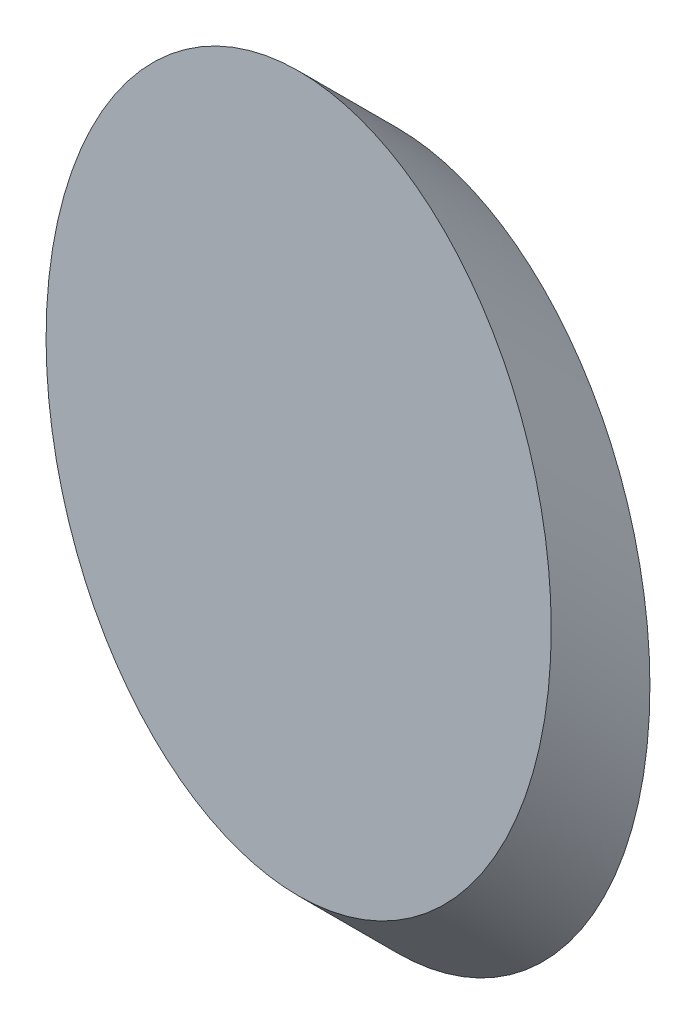
ISO-10303-21;
HEADER;
FILE_DESCRIPTION(('STEP AP214'),'2;1');
FILE_NAME('part.step','',(''),(''),'','','');
FILE_SCHEMA(('AUTOMOTIVE_DESIGN { 1 0 10303 214 1 1 1 1 }'));
ENDSEC;
DATA;
#1=APPLICATION_CONTEXT('core data for automotive mechanical design processes');
#2=APPLICATION_PROTOCOL_DEFINITION('international standard','automotive_design',2000,#1);
#3=PRODUCT_CONTEXT('',#1,'mechanical');
#4=PRODUCT('Part','Part','',(#3));
#5=PRODUCT_RELATED_PRODUCT_CATEGORY('part','',(#4));
#6=PRODUCT_DEFINITION_FORMATION('','',#4);
#7=PRODUCT_DEFINITION_CONTEXT('part definition',#1,'design');
#8=PRODUCT_DEFINITION('design','',#6,#7);
#9=PRODUCT_DEFINITION_SHAPE('','',#8);
#10=(LENGTH_UNIT() NAMED_UNIT(*) SI_UNIT(.MILLI.,.METRE.));
#11=(NAMED_UNIT(*) PLANE_ANGLE_UNIT() SI_UNIT($,.RADIAN.));
#12=(NAMED_UNIT(*) SI_UNIT($,.STERADIAN.) SOLID_ANGLE_UNIT());
#13=UNCERTAINTY_MEASURE_WITH_UNIT(LENGTH_MEASURE(1.E-05),#10,'distance_accuracy_value','');
#14=(GEOMETRIC_REPRESENTATION_CONTEXT(3) GLOBAL_UNCERTAINTY_ASSIGNED_CONTEXT((#13)) GLOBAL_UNIT_ASSIGNED_CONTEXT((#10,
#11,#12)) REPRESENTATION_CONTEXT('',''));
#15=CARTESIAN_POINT('',(0.,0.,0.));
#16=DIRECTION('',(0.,0.,1.));
#17=DIRECTION('',(1.,0.,0.));
#18=AXIS2_PLACEMENT_3D('',#15,#16,#17);
#19=CARTESIAN_POINT('',(54.3923829817161,48.2905194217003,12.5016478913781));
#20=DIRECTION('',(0.,0.,1.));
#21=DIRECTION('',(0.,1.,0.));
#22=AXIS2_PLACEMENT_3D('',#19,#20,#21);
#23=ELLIPSE('',#22,45.26,32.);
#24=DIRECTION('',(0.,-0.70710678118655,-0.707106781186545));
#25=VECTOR('',#24,1.);
#26=SURFACE_OF_LINEAR_EXTRUSION('',#23,#25);
#27=CARTESIAN_POINT('',(54.3923829817161,93.5505194217003,12.5016478913781));
#28=VERTEX_POINT('',#27);
#29=EDGE_CURVE('E10',#28,#28,#23,.T.);
#30=ORIENTED_EDGE('',*,*,#29,.F.);
#31=EDGE_LOOP('',(#30));
#32=FACE_BOUND('',#31,.T.);
#33=CARTESIAN_POINT('',(54.3923829817161,35.7888715303221,0.));
#34=DIRECTION('',(0.,0.,1.));
#35=DIRECTION('',(0.,1.,0.));
#36=AXIS2_PLACEMENT_3D('',#33,#34,#35);
#37=ELLIPSE('',#36,45.26,32.);
#38=CARTESIAN_POINT('',(54.3923829817161,81.0488715303221,0.));
#39=VERTEX_POINT('',#38);
#40=EDGE_CURVE('E39',#39,#39,#37,.T.);
#41=ORIENTED_EDGE('',*,*,#40,.T.);
#42=EDGE_LOOP('',(#41));
#43=FACE_BOUND('',#42,.T.);
#44=ADVANCED_FACE('F35',(#32,#43),#26,.F.);
#45=CARTESIAN_POINT('',(54.3923829817161,48.2905194217003,12.5016478913781));
#46=DIRECTION('',(0.,0.,1.));
#47=DIRECTION('',(1.,0.,0.));
#48=AXIS2_PLACEMENT_3D('',#45,#46,#47);
#49=PLANE('',#48);
#50=ORIENTED_EDGE('',*,*,#29,.T.);
#51=EDGE_LOOP('',(#50));
#52=FACE_BOUND('',#51,.T.);
#53=ADVANCED_FACE('F51',(#52),#49,.T.);
#54=CARTESIAN_POINT('',(54.3923829817161,35.7888715303221,0.));
#55=DIRECTION('',(0.,0.,1.));
#56=DIRECTION('',(1.,0.,0.));
#57=AXIS2_PLACEMENT_3D('',#54,#55,#56);
#58=PLANE('',#57);
#59=ORIENTED_EDGE('',*,*,#40,.F.);
#60=EDGE_LOOP('',(#59));
#61=FACE_BOUND('',#60,.T.);
#62=ADVANCED_FACE('F49',(#61),#58,.F.);
#63=CLOSED_SHELL('',(#44,#53,#62));
#64=MANIFOLD_SOLID_BREP('B2',#63);
#65=ADVANCED_BREP_SHAPE_REPRESENTATION('',(#18,#64),#14);
#66=SHAPE_DEFINITION_REPRESENTATION(#9,#65);
ENDSEC;
END-ISO-10303-21;
